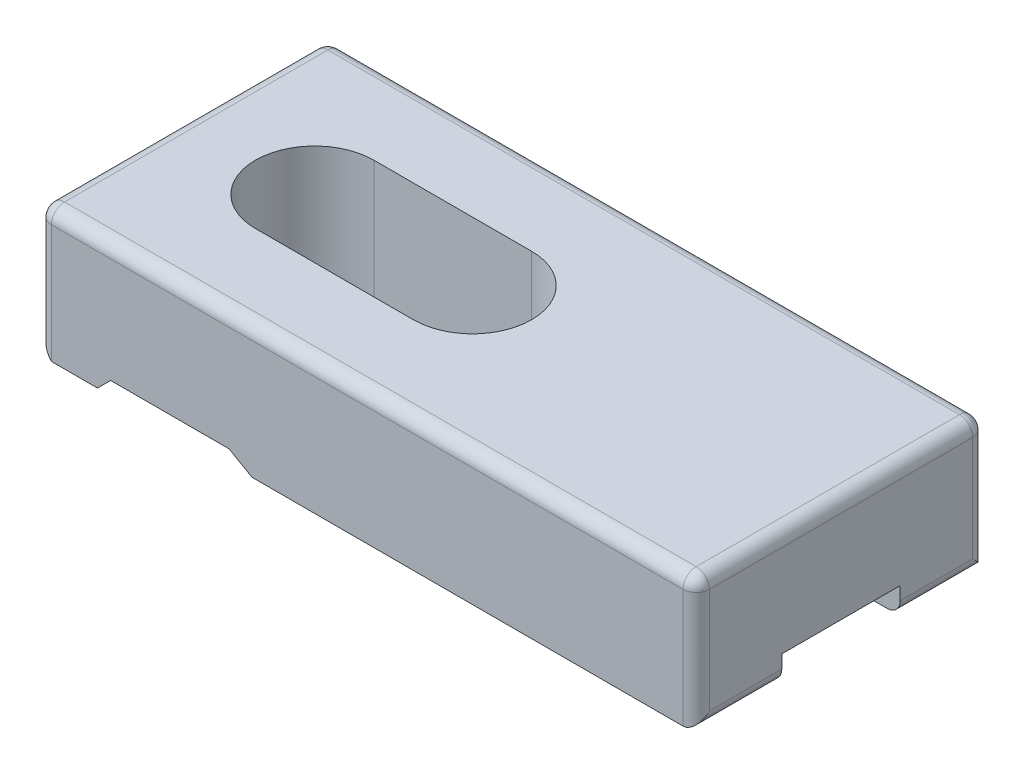
ISO-10303-21;
HEADER;
FILE_DESCRIPTION(('STEP AP214'),'2;1');
FILE_NAME('part.step','',(''),(''),'','','');
FILE_SCHEMA(('AUTOMOTIVE_DESIGN { 1 0 10303 214 1 1 1 1 }'));
ENDSEC;
DATA;
#1=APPLICATION_CONTEXT('core data for automotive mechanical design processes');
#2=APPLICATION_PROTOCOL_DEFINITION('international standard','automotive_design',2000,#1);
#3=PRODUCT_CONTEXT('',#1,'mechanical');
#4=PRODUCT('Part','Part','',(#3));
#5=PRODUCT_RELATED_PRODUCT_CATEGORY('part','',(#4));
#6=PRODUCT_DEFINITION_FORMATION('','',#4);
#7=PRODUCT_DEFINITION_CONTEXT('part definition',#1,'design');
#8=PRODUCT_DEFINITION('design','',#6,#7);
#9=PRODUCT_DEFINITION_SHAPE('','',#8);
#10=(LENGTH_UNIT() NAMED_UNIT(*) SI_UNIT(.MILLI.,.METRE.));
#11=(NAMED_UNIT(*) PLANE_ANGLE_UNIT() SI_UNIT($,.RADIAN.));
#12=(NAMED_UNIT(*) SI_UNIT($,.STERADIAN.) SOLID_ANGLE_UNIT());
#13=UNCERTAINTY_MEASURE_WITH_UNIT(LENGTH_MEASURE(1.E-05),#10,'distance_accuracy_value','');
#14=(GEOMETRIC_REPRESENTATION_CONTEXT(3) GLOBAL_UNCERTAINTY_ASSIGNED_CONTEXT((#13)) GLOBAL_UNIT_ASSIGNED_CONTEXT((#10,
#11,#12)) REPRESENTATION_CONTEXT('',''));
#15=CARTESIAN_POINT('',(0.,0.,0.));
#16=DIRECTION('',(0.,0.,1.));
#17=DIRECTION('',(1.,0.,0.));
#18=AXIS2_PLACEMENT_3D('',#15,#16,#17);
#19=CARTESIAN_POINT('',(0.,0.,0.));
#20=DIRECTION('',(0.,-1.,0.));
#21=DIRECTION('',(0.,0.,-1.));
#22=AXIS2_PLACEMENT_3D('',#19,#20,#21);
#23=PLANE('',#22);
#24=DIRECTION('',(-1.,0.,0.));
#25=VECTOR('',#24,1.);
#26=CARTESIAN_POINT('',(0.,0.,-6.5));
#27=LINE('',#26,#25);
#28=CARTESIAN_POINT('',(4.49999999999999,0.,-6.5));
#29=VERTEX_POINT('',#28);
#30=CARTESIAN_POINT('',(1.00000000000001,0.,-6.5));
#31=VERTEX_POINT('',#30);
#32=EDGE_CURVE('E260',#29,#31,#27,.T.);
#33=ORIENTED_EDGE('',*,*,#32,.F.);
#34=DIRECTION('',(0.,0.,1.));
#35=VECTOR('',#34,1.);
#36=CARTESIAN_POINT('',(4.49999999999999,0.,0.));
#37=LINE('',#36,#35);
#38=CARTESIAN_POINT('',(4.49999999999999,0.,0.));
#39=VERTEX_POINT('',#38);
#40=EDGE_CURVE('E348',#29,#39,#37,.T.);
#41=ORIENTED_EDGE('',*,*,#40,.T.);
#42=DIRECTION('',(1.,0.,0.));
#43=VECTOR('',#42,1.);
#44=CARTESIAN_POINT('',(0.,0.,0.));
#45=LINE('',#44,#43);
#46=CARTESIAN_POINT('',(1.00000000000001,0.,0.));
#47=VERTEX_POINT('',#46);
#48=EDGE_CURVE('E328',#47,#39,#45,.T.);
#49=ORIENTED_EDGE('',*,*,#48,.F.);
#50=DIRECTION('',(0.,0.,-1.));
#51=VECTOR('',#50,1.);
#52=CARTESIAN_POINT('',(1.00000000000001,0.,-6.5));
#53=LINE('',#52,#51);
#54=EDGE_CURVE('E346',#47,#31,#53,.T.);
#55=ORIENTED_EDGE('',*,*,#54,.T.);
#56=EDGE_LOOP('',(#33,#41,#49,#55));
#57=FACE_BOUND('',#56,.T.);
#58=ADVANCED_FACE('F36',(#57),#23,.T.);
#59=DIRECTION('',(-1.,0.,0.));
#60=VECTOR('',#59,1.);
#61=CARTESIAN_POINT('',(0.,0.,-22.));
#62=LINE('',#61,#60);
#63=CARTESIAN_POINT('',(49.,0.,-22.));
#64=VERTEX_POINT('',#63);
#65=CARTESIAN_POINT('',(16.2320508075689,0.,-22.));
#66=VERTEX_POINT('',#65);
#67=EDGE_CURVE('E332',#64,#66,#62,.T.);
#68=ORIENTED_EDGE('',*,*,#67,.F.);
#69=DIRECTION('',(0.,0.,-1.));
#70=VECTOR('',#69,1.);
#71=CARTESIAN_POINT('',(49.,0.,-15.5));
#72=LINE('',#71,#70);
#73=CARTESIAN_POINT('',(49.,0.,-15.5));
#74=VERTEX_POINT('',#73);
#75=EDGE_CURVE('E61',#64,#74,#72,.F.);
#76=ORIENTED_EDGE('',*,*,#75,.T.);
#77=DIRECTION('',(-1.,0.,0.));
#78=VECTOR('',#77,1.);
#79=CARTESIAN_POINT('',(22.,0.,-15.5));
#80=LINE('',#79,#78);
#81=CARTESIAN_POINT('',(16.2320508075689,0.,-15.5));
#82=VERTEX_POINT('',#81);
#83=EDGE_CURVE('E302',#74,#82,#80,.T.);
#84=ORIENTED_EDGE('',*,*,#83,.T.);
#85=DIRECTION('',(0.,0.,-1.));
#86=VECTOR('',#85,1.);
#87=CARTESIAN_POINT('',(16.2320508075689,0.,-22.));
#88=LINE('',#87,#86);
#89=EDGE_CURVE('E355',#82,#66,#88,.T.);
#90=ORIENTED_EDGE('',*,*,#89,.T.);
#91=EDGE_LOOP('',(#68,#76,#84,#90));
#92=FACE_BOUND('',#91,.T.);
#93=ADVANCED_FACE('F556',(#92),#23,.T.);
#94=DIRECTION('',(1.,0.,0.));
#95=VECTOR('',#94,1.);
#96=CARTESIAN_POINT('',(22.,0.,-6.5));
#97=LINE('',#96,#95);
#98=CARTESIAN_POINT('',(16.2320508075689,0.,-6.5));
#99=VERTEX_POINT('',#98);
#100=CARTESIAN_POINT('',(49.,0.,-6.5));
#101=VERTEX_POINT('',#100);
#102=EDGE_CURVE('E306',#99,#101,#97,.T.);
#103=ORIENTED_EDGE('',*,*,#102,.T.);
#104=DIRECTION('',(0.,0.,-1.));
#105=VECTOR('',#104,1.);
#106=CARTESIAN_POINT('',(49.,0.,0.));
#107=LINE('',#106,#105);
#108=CARTESIAN_POINT('',(49.,0.,0.));
#109=VERTEX_POINT('',#108);
#110=EDGE_CURVE('E406',#101,#109,#107,.F.);
#111=ORIENTED_EDGE('',*,*,#110,.T.);
#112=CARTESIAN_POINT('',(16.2320508075689,0.,0.));
#113=VERTEX_POINT('',#112);
#114=EDGE_CURVE('E327',#113,#109,#45,.T.);
#115=ORIENTED_EDGE('',*,*,#114,.F.);
#116=DIRECTION('',(0.,0.,-1.));
#117=VECTOR('',#116,1.);
#118=CARTESIAN_POINT('',(16.2320508075689,0.,-6.5));
#119=LINE('',#118,#117);
#120=EDGE_CURVE('E362',#113,#99,#119,.T.);
#121=ORIENTED_EDGE('',*,*,#120,.T.);
#122=EDGE_LOOP('',(#103,#111,#115,#121));
#123=FACE_BOUND('',#122,.T.);
#124=ADVANCED_FACE('F558',(#123),#23,.T.);
#125=CARTESIAN_POINT('',(10.,10.,-11.));
#126=DIRECTION('',(0.,-1.,0.));
#127=DIRECTION('',(0.,0.,-1.));
#128=AXIS2_PLACEMENT_3D('',#125,#126,#127);
#129=CYLINDRICAL_SURFACE('',#128,4.5);
#130=DIRECTION('',(0.,-1.,0.));
#131=VECTOR('',#130,1.);
#132=CARTESIAN_POINT('',(10.,10.,-6.5));
#133=LINE('',#132,#131);
#134=CARTESIAN_POINT('',(10.,10.,-6.5));
#135=VERTEX_POINT('',#134);
#136=CARTESIAN_POINT('',(10.,0.999999999999999,-6.5));
#137=VERTEX_POINT('',#136);
#138=EDGE_CURVE('E318',#135,#137,#133,.T.);
#139=ORIENTED_EDGE('',*,*,#138,.T.);
#140=CARTESIAN_POINT('',(10.,0.999999999999999,-11.));
#141=DIRECTION('',(0.,-1.,0.));
#142=DIRECTION('',(0.,0.,-1.));
#143=AXIS2_PLACEMENT_3D('',#140,#141,#142);
#144=CIRCLE('',#143,4.5);
#145=CARTESIAN_POINT('',(10.,0.999999999999999,-15.5));
#146=VERTEX_POINT('',#145);
#147=EDGE_CURVE('E280',#137,#146,#144,.T.);
#148=ORIENTED_EDGE('',*,*,#147,.T.);
#149=DIRECTION('',(0.,-1.,0.));
#150=VECTOR('',#149,1.);
#151=CARTESIAN_POINT('',(10.,10.,-15.5));
#152=LINE('',#151,#150);
#153=CARTESIAN_POINT('',(10.,10.,-15.5));
#154=VERTEX_POINT('',#153);
#155=EDGE_CURVE('E321',#154,#146,#152,.T.);
#156=ORIENTED_EDGE('',*,*,#155,.F.);
#157=CARTESIAN_POINT('',(10.,10.,-11.));
#158=DIRECTION('',(0.,1.,0.));
#159=DIRECTION('',(0.,0.,1.));
#160=AXIS2_PLACEMENT_3D('',#157,#158,#159);
#161=CIRCLE('',#160,4.5);
#162=EDGE_CURVE('E308',#154,#135,#161,.T.);
#163=ORIENTED_EDGE('',*,*,#162,.T.);
#164=EDGE_LOOP('',(#139,#148,#156,#163));
#165=FACE_BOUND('',#164,.T.);
#166=ADVANCED_FACE('F480',(#165),#129,.F.);
#167=CARTESIAN_POINT('',(22.,10.,-11.));
#168=DIRECTION('',(0.,-1.,0.));
#169=DIRECTION('',(0.,0.,-1.));
#170=AXIS2_PLACEMENT_3D('',#167,#168,#169);
#171=CYLINDRICAL_SURFACE('',#170,4.5);
#172=DIRECTION('',(0.,-1.,0.));
#173=VECTOR('',#172,1.);
#174=CARTESIAN_POINT('',(22.,10.,-15.5));
#175=LINE('',#174,#173);
#176=CARTESIAN_POINT('',(22.,10.,-15.5));
#177=VERTEX_POINT('',#176);
#178=CARTESIAN_POINT('',(22.,2.,-15.5));
#179=VERTEX_POINT('',#178);
#180=EDGE_CURVE('E324',#177,#179,#175,.T.);
#181=ORIENTED_EDGE('',*,*,#180,.T.);
#182=CARTESIAN_POINT('',(22.,2.,-11.));
#183=DIRECTION('',(0.,-1.,0.));
#184=DIRECTION('',(0.,0.,-1.));
#185=AXIS2_PLACEMENT_3D('',#182,#183,#184);
#186=CIRCLE('',#185,4.5);
#187=CARTESIAN_POINT('',(22.,2.,-6.5));
#188=VERTEX_POINT('',#187);
#189=EDGE_CURVE('E297',#179,#188,#186,.T.);
#190=ORIENTED_EDGE('',*,*,#189,.T.);
#191=DIRECTION('',(0.,-1.,0.));
#192=VECTOR('',#191,1.);
#193=CARTESIAN_POINT('',(22.,10.,-6.5));
#194=LINE('',#193,#192);
#195=CARTESIAN_POINT('',(22.,10.,-6.5));
#196=VERTEX_POINT('',#195);
#197=EDGE_CURVE('E313',#196,#188,#194,.T.);
#198=ORIENTED_EDGE('',*,*,#197,.F.);
#199=CARTESIAN_POINT('',(22.,10.,-11.));
#200=DIRECTION('',(0.,1.,0.));
#201=DIRECTION('',(0.,0.,1.));
#202=AXIS2_PLACEMENT_3D('',#199,#200,#201);
#203=CIRCLE('',#202,4.5);
#204=EDGE_CURVE('E303',#196,#177,#203,.T.);
#205=ORIENTED_EDGE('',*,*,#204,.T.);
#206=EDGE_LOOP('',(#181,#190,#198,#205));
#207=FACE_BOUND('',#206,.T.);
#208=ADVANCED_FACE('F471',(#207),#171,.F.);
#209=CARTESIAN_POINT('',(0.,10.,0.));
#210=DIRECTION('',(0.,-1.,0.));
#211=DIRECTION('',(0.,0.,-1.));
#212=AXIS2_PLACEMENT_3D('',#209,#210,#211);
#213=PLANE('',#212);
#214=DIRECTION('',(-1.,0.,0.));
#215=VECTOR('',#214,1.);
#216=CARTESIAN_POINT('',(0.,10.,-21.));
#217=LINE('',#216,#215);
#218=CARTESIAN_POINT('',(49.,10.,-21.));
#219=VERTEX_POINT('',#218);
#220=CARTESIAN_POINT('',(1.,10.,-21.));
#221=VERTEX_POINT('',#220);
#222=EDGE_CURVE('E370',#219,#221,#217,.T.);
#223=ORIENTED_EDGE('',*,*,#222,.T.);
#224=DIRECTION('',(0.,0.,1.));
#225=VECTOR('',#224,1.);
#226=CARTESIAN_POINT('',(1.,10.,0.));
#227=LINE('',#226,#225);
#228=CARTESIAN_POINT('',(1.,10.,-1.));
#229=VERTEX_POINT('',#228);
#230=EDGE_CURVE('E372',#221,#229,#227,.T.);
#231=ORIENTED_EDGE('',*,*,#230,.T.);
#232=DIRECTION('',(1.,0.,0.));
#233=VECTOR('',#232,1.);
#234=CARTESIAN_POINT('',(0.,10.,-1.));
#235=LINE('',#234,#233);
#236=CARTESIAN_POINT('',(49.,10.,-1.));
#237=VERTEX_POINT('',#236);
#238=EDGE_CURVE('E366',#229,#237,#235,.T.);
#239=ORIENTED_EDGE('',*,*,#238,.T.);
#240=DIRECTION('',(0.,0.,-1.));
#241=VECTOR('',#240,1.);
#242=CARTESIAN_POINT('',(49.,10.,0.));
#243=LINE('',#242,#241);
#244=EDGE_CURVE('E368',#237,#219,#243,.T.);
#245=ORIENTED_EDGE('',*,*,#244,.T.);
#246=EDGE_LOOP('',(#223,#231,#239,#245));
#247=FACE_BOUND('',#246,.T.);
#248=ORIENTED_EDGE('',*,*,#204,.F.);
#249=DIRECTION('',(1.,0.,0.));
#250=VECTOR('',#249,1.);
#251=CARTESIAN_POINT('',(22.,10.,-6.5));
#252=LINE('',#251,#250);
#253=EDGE_CURVE('E311',#135,#196,#252,.T.);
#254=ORIENTED_EDGE('',*,*,#253,.F.);
#255=ORIENTED_EDGE('',*,*,#162,.F.);
#256=DIRECTION('',(-1.,0.,0.));
#257=VECTOR('',#256,1.);
#258=CARTESIAN_POINT('',(22.,10.,-15.5));
#259=LINE('',#258,#257);
#260=EDGE_CURVE('E305',#177,#154,#259,.T.);
#261=ORIENTED_EDGE('',*,*,#260,.F.);
#262=EDGE_LOOP('',(#248,#254,#255,#261));
#263=FACE_BOUND('',#262,.T.);
#264=ADVANCED_FACE('F476',(#247,#263),#213,.F.);
#265=CARTESIAN_POINT('',(4.49999999999999,0.,-22.));
#266=VERTEX_POINT('',#265);
#267=CARTESIAN_POINT('',(1.00000000000001,0.,-22.));
#268=VERTEX_POINT('',#267);
#269=EDGE_CURVE('E331',#266,#268,#62,.T.);
#270=ORIENTED_EDGE('',*,*,#269,.F.);
#271=DIRECTION('',(0.,0.,1.));
#272=VECTOR('',#271,1.);
#273=CARTESIAN_POINT('',(4.49999999999999,0.,-15.5));
#274=LINE('',#273,#272);
#275=CARTESIAN_POINT('',(4.49999999999999,0.,-15.5));
#276=VERTEX_POINT('',#275);
#277=EDGE_CURVE('E244',#266,#276,#274,.T.);
#278=ORIENTED_EDGE('',*,*,#277,.T.);
#279=DIRECTION('',(1.,0.,0.));
#280=VECTOR('',#279,1.);
#281=CARTESIAN_POINT('',(0.,0.,-15.5));
#282=LINE('',#281,#280);
#283=CARTESIAN_POINT('',(1.00000000000001,0.,-15.5));
#284=VERTEX_POINT('',#283);
#285=EDGE_CURVE('E263',#284,#276,#282,.T.);
#286=ORIENTED_EDGE('',*,*,#285,.F.);
#287=DIRECTION('',(0.,0.,-1.));
#288=VECTOR('',#287,1.);
#289=CARTESIAN_POINT('',(1.00000000000001,0.,-22.));
#290=LINE('',#289,#288);
#291=EDGE_CURVE('E239',#284,#268,#290,.T.);
#292=ORIENTED_EDGE('',*,*,#291,.T.);
#293=EDGE_LOOP('',(#270,#278,#286,#292));
#294=FACE_BOUND('',#293,.T.);
#295=ADVANCED_FACE('F544',(#294),#23,.T.);
#296=CARTESIAN_POINT('',(0.,10.,0.));
#297=DIRECTION('',(1.,0.,0.));
#298=DIRECTION('',(0.,0.,-1.));
#299=AXIS2_PLACEMENT_3D('',#296,#297,#298);
#300=PLANE('',#299);
#301=DIRECTION('',(0.,0.,1.));
#302=VECTOR('',#301,1.);
#303=CARTESIAN_POINT('',(0.,9.,0.));
#304=LINE('',#303,#302);
#305=CARTESIAN_POINT('',(0.,9.,-1.));
#306=VERTEX_POINT('',#305);
#307=CARTESIAN_POINT('',(0.,9.,-21.));
#308=VERTEX_POINT('',#307);
#309=EDGE_CURVE('E377',#306,#308,#304,.F.);
#310=ORIENTED_EDGE('',*,*,#309,.T.);
#311=DIRECTION('',(0.,-1.,0.));
#312=VECTOR('',#311,1.);
#313=CARTESIAN_POINT('',(0.,10.,-21.));
#314=LINE('',#313,#312);
#315=CARTESIAN_POINT('',(0.,1.00000000000001,-21.));
#316=VERTEX_POINT('',#315);
#317=EDGE_CURVE('E228',#308,#316,#314,.T.);
#318=ORIENTED_EDGE('',*,*,#317,.T.);
#319=DIRECTION('',(0.,0.,1.));
#320=VECTOR('',#319,1.);
#321=CARTESIAN_POINT('',(0.,1.00000000000001,-15.5));
#322=LINE('',#321,#320);
#323=CARTESIAN_POINT('',(0.,1.,-15.5));
#324=VERTEX_POINT('',#323);
#325=EDGE_CURVE('E219',#316,#324,#322,.T.);
#326=ORIENTED_EDGE('',*,*,#325,.T.);
#327=DIRECTION('',(0.,0.,-1.));
#328=VECTOR('',#327,1.);
#329=CARTESIAN_POINT('',(0.,1.,-6.5));
#330=LINE('',#329,#328);
#331=CARTESIAN_POINT('',(0.,1.,-6.5));
#332=VERTEX_POINT('',#331);
#333=EDGE_CURVE('E225',#332,#324,#330,.T.);
#334=ORIENTED_EDGE('',*,*,#333,.F.);
#335=DIRECTION('',(0.,0.,1.));
#336=VECTOR('',#335,1.);
#337=CARTESIAN_POINT('',(0.,1.00000000000001,0.));
#338=LINE('',#337,#336);
#339=CARTESIAN_POINT('',(0.,1.00000000000001,-1.));
#340=VERTEX_POINT('',#339);
#341=EDGE_CURVE('E231',#332,#340,#338,.T.);
#342=ORIENTED_EDGE('',*,*,#341,.T.);
#343=DIRECTION('',(0.,-1.,0.));
#344=VECTOR('',#343,1.);
#345=CARTESIAN_POINT('',(0.,10.,-1.));
#346=LINE('',#345,#344);
#347=EDGE_CURVE('E375',#340,#306,#346,.F.);
#348=ORIENTED_EDGE('',*,*,#347,.T.);
#349=EDGE_LOOP('',(#310,#318,#326,#334,#342,#348));
#350=FACE_BOUND('',#349,.T.);
#351=ADVANCED_FACE('F222',(#350),#300,.F.);
#352=CARTESIAN_POINT('',(0.,10.,0.));
#353=DIRECTION('',(0.,0.,-1.));
#354=DIRECTION('',(-1.,0.,0.));
#355=AXIS2_PLACEMENT_3D('',#352,#353,#354);
#356=PLANE('',#355);
#357=ORIENTED_EDGE('',*,*,#114,.T.);
#358=DIRECTION('',(0.,-1.,0.));
#359=VECTOR('',#358,1.);
#360=CARTESIAN_POINT('',(49.,10.,0.));
#361=LINE('',#360,#359);
#362=CARTESIAN_POINT('',(49.,9.,0.));
#363=VERTEX_POINT('',#362);
#364=EDGE_CURVE('E400',#109,#363,#361,.F.);
#365=ORIENTED_EDGE('',*,*,#364,.T.);
#366=DIRECTION('',(1.,0.,0.));
#367=VECTOR('',#366,1.);
#368=CARTESIAN_POINT('',(0.,9.,0.));
#369=LINE('',#368,#367);
#370=CARTESIAN_POINT('',(1.,9.,0.));
#371=VERTEX_POINT('',#370);
#372=EDGE_CURVE('E398',#363,#371,#369,.F.);
#373=ORIENTED_EDGE('',*,*,#372,.T.);
#374=DIRECTION('',(0.,-1.,0.));
#375=VECTOR('',#374,1.);
#376=CARTESIAN_POINT('',(1.,10.,0.));
#377=LINE('',#376,#375);
#378=EDGE_CURVE('E396',#371,#47,#377,.T.);
#379=ORIENTED_EDGE('',*,*,#378,.T.);
#380=ORIENTED_EDGE('',*,*,#48,.T.);
#381=DIRECTION('',(0.707106781186548,0.707106781186548,0.));
#382=VECTOR('',#381,1.);
#383=CARTESIAN_POINT('',(5.5,1.00000000000001,0.));
#384=LINE('',#383,#382);
#385=CARTESIAN_POINT('',(5.5,1.,0.));
#386=VERTEX_POINT('',#385);
#387=EDGE_CURVE('E232',#39,#386,#384,.T.);
#388=ORIENTED_EDGE('',*,*,#387,.T.);
#389=DIRECTION('',(-1.,0.,0.));
#390=VECTOR('',#389,1.);
#391=CARTESIAN_POINT('',(5.5,1.,0.));
#392=LINE('',#391,#390);
#393=CARTESIAN_POINT('',(14.5,1.,0.));
#394=VERTEX_POINT('',#393);
#395=EDGE_CURVE('E274',#394,#386,#392,.T.);
#396=ORIENTED_EDGE('',*,*,#395,.F.);
#397=DIRECTION('',(0.866025403784438,-0.500000000000001,0.));
#398=VECTOR('',#397,1.);
#399=CARTESIAN_POINT('',(14.5,1.,0.));
#400=LINE('',#399,#398);
#401=EDGE_CURVE('E360',#394,#113,#400,.T.);
#402=ORIENTED_EDGE('',*,*,#401,.T.);
#403=EDGE_LOOP('',(#357,#365,#373,#379,#380,#388,#396,#402));
#404=FACE_BOUND('',#403,.T.);
#405=ADVANCED_FACE('F493',(#404),#356,.F.);
#406=CARTESIAN_POINT('',(50.,10.,0.));
#407=DIRECTION('',(-1.,0.,0.));
#408=DIRECTION('',(0.,0.,1.));
#409=AXIS2_PLACEMENT_3D('',#406,#407,#408);
#410=PLANE('',#409);
#411=DIRECTION('',(0.,-1.,0.));
#412=VECTOR('',#411,1.);
#413=CARTESIAN_POINT('',(50.,10.,-1.));
#414=LINE('',#413,#412);
#415=CARTESIAN_POINT('',(50.,9.,-1.));
#416=VERTEX_POINT('',#415);
#417=CARTESIAN_POINT('',(50.,0.999999999999999,-1.));
#418=VERTEX_POINT('',#417);
#419=EDGE_CURVE('E392',#416,#418,#414,.T.);
#420=ORIENTED_EDGE('',*,*,#419,.T.);
#421=DIRECTION('',(0.,0.,-1.));
#422=VECTOR('',#421,1.);
#423=CARTESIAN_POINT('',(50.,0.999999999999999,-6.5));
#424=LINE('',#423,#422);
#425=CARTESIAN_POINT('',(50.,0.999999999999999,-6.5));
#426=VERTEX_POINT('',#425);
#427=EDGE_CURVE('E394',#418,#426,#424,.T.);
#428=ORIENTED_EDGE('',*,*,#427,.T.);
#429=DIRECTION('',(0.,-1.,0.));
#430=VECTOR('',#429,1.);
#431=CARTESIAN_POINT('',(50.,2.,-6.5));
#432=LINE('',#431,#430);
#433=CARTESIAN_POINT('',(50.,2.,-6.5));
#434=VERTEX_POINT('',#433);
#435=EDGE_CURVE('E295',#434,#426,#432,.T.);
#436=ORIENTED_EDGE('',*,*,#435,.F.);
#437=DIRECTION('',(0.,0.,1.));
#438=VECTOR('',#437,1.);
#439=CARTESIAN_POINT('',(50.,2.,-6.5));
#440=LINE('',#439,#438);
#441=CARTESIAN_POINT('',(50.,2.,-15.5));
#442=VERTEX_POINT('',#441);
#443=EDGE_CURVE('E291',#442,#434,#440,.T.);
#444=ORIENTED_EDGE('',*,*,#443,.F.);
#445=DIRECTION('',(0.,-1.,0.));
#446=VECTOR('',#445,1.);
#447=CARTESIAN_POINT('',(50.,2.,-15.5));
#448=LINE('',#447,#446);
#449=CARTESIAN_POINT('',(50.,0.999999999999999,-15.5));
#450=VERTEX_POINT('',#449);
#451=EDGE_CURVE('E294',#442,#450,#448,.T.);
#452=ORIENTED_EDGE('',*,*,#451,.T.);
#453=DIRECTION('',(0.,0.,-1.));
#454=VECTOR('',#453,1.);
#455=CARTESIAN_POINT('',(50.,0.999999999999999,-22.));
#456=LINE('',#455,#454);
#457=CARTESIAN_POINT('',(50.,0.999999999999999,-21.));
#458=VERTEX_POINT('',#457);
#459=EDGE_CURVE('E388',#450,#458,#456,.T.);
#460=ORIENTED_EDGE('',*,*,#459,.T.);
#461=DIRECTION('',(0.,-1.,0.));
#462=VECTOR('',#461,1.);
#463=CARTESIAN_POINT('',(50.,10.,-21.));
#464=LINE('',#463,#462);
#465=CARTESIAN_POINT('',(50.,9.,-21.));
#466=VERTEX_POINT('',#465);
#467=EDGE_CURVE('E386',#458,#466,#464,.F.);
#468=ORIENTED_EDGE('',*,*,#467,.T.);
#469=DIRECTION('',(0.,0.,-1.));
#470=VECTOR('',#469,1.);
#471=CARTESIAN_POINT('',(50.,9.,0.));
#472=LINE('',#471,#470);
#473=EDGE_CURVE('E390',#466,#416,#472,.F.);
#474=ORIENTED_EDGE('',*,*,#473,.T.);
#475=EDGE_LOOP('',(#420,#428,#436,#444,#452,#460,#468,#474));
#476=FACE_BOUND('',#475,.T.);
#477=ADVANCED_FACE('F464',(#476),#410,.F.);
#478=CARTESIAN_POINT('',(0.,10.,-22.));
#479=DIRECTION('',(0.,0.,1.));
#480=DIRECTION('',(1.,0.,0.));
#481=AXIS2_PLACEMENT_3D('',#478,#479,#480);
#482=PLANE('',#481);
#483=DIRECTION('',(-1.,0.,0.));
#484=VECTOR('',#483,1.);
#485=CARTESIAN_POINT('',(0.,9.,-22.));
#486=LINE('',#485,#484);
#487=CARTESIAN_POINT('',(1.,9.,-22.));
#488=VERTEX_POINT('',#487);
#489=CARTESIAN_POINT('',(49.,9.,-22.));
#490=VERTEX_POINT('',#489);
#491=EDGE_CURVE('E382',#488,#490,#486,.F.);
#492=ORIENTED_EDGE('',*,*,#491,.T.);
#493=DIRECTION('',(0.,-1.,0.));
#494=VECTOR('',#493,1.);
#495=CARTESIAN_POINT('',(49.,10.,-22.));
#496=LINE('',#495,#494);
#497=EDGE_CURVE('E384',#490,#64,#496,.T.);
#498=ORIENTED_EDGE('',*,*,#497,.T.);
#499=ORIENTED_EDGE('',*,*,#67,.T.);
#500=DIRECTION('',(-0.866025403784438,0.500000000000001,0.));
#501=VECTOR('',#500,1.);
#502=CARTESIAN_POINT('',(14.5,1.,-22.));
#503=LINE('',#502,#501);
#504=CARTESIAN_POINT('',(14.5,1.,-22.));
#505=VERTEX_POINT('',#504);
#506=EDGE_CURVE('E358',#66,#505,#503,.T.);
#507=ORIENTED_EDGE('',*,*,#506,.T.);
#508=DIRECTION('',(1.,0.,0.));
#509=VECTOR('',#508,1.);
#510=CARTESIAN_POINT('',(5.5,1.,-22.));
#511=LINE('',#510,#509);
#512=CARTESIAN_POINT('',(5.5,1.,-22.));
#513=VERTEX_POINT('',#512);
#514=EDGE_CURVE('E267',#513,#505,#511,.T.);
#515=ORIENTED_EDGE('',*,*,#514,.F.);
#516=DIRECTION('',(-0.707106781186547,-0.707106781186548,0.));
#517=VECTOR('',#516,1.);
#518=CARTESIAN_POINT('',(5.5,1.00000000000001,-22.));
#519=LINE('',#518,#517);
#520=EDGE_CURVE('E337',#513,#266,#519,.T.);
#521=ORIENTED_EDGE('',*,*,#520,.T.);
#522=ORIENTED_EDGE('',*,*,#269,.T.);
#523=DIRECTION('',(0.,-1.,0.));
#524=VECTOR('',#523,1.);
#525=CARTESIAN_POINT('',(1.,10.,-22.));
#526=LINE('',#525,#524);
#527=EDGE_CURVE('E380',#268,#488,#526,.F.);
#528=ORIENTED_EDGE('',*,*,#527,.T.);
#529=EDGE_LOOP('',(#492,#498,#499,#507,#515,#521,#522,#528));
#530=FACE_BOUND('',#529,.T.);
#531=ADVANCED_FACE('F547',(#530),#482,.F.);
#532=CARTESIAN_POINT('',(22.,10.,-15.5));
#533=DIRECTION('',(0.,0.,1.));
#534=DIRECTION('',(1.,0.,0.));
#535=AXIS2_PLACEMENT_3D('',#532,#533,#534);
#536=PLANE('',#535);
#537=ORIENTED_EDGE('',*,*,#83,.F.);
#538=CARTESIAN_POINT('',(49.,0.999999999999999,-15.5));
#539=DIRECTION('',(0.,0.,1.));
#540=DIRECTION('',(1.,0.,0.));
#541=AXIS2_PLACEMENT_3D('',#538,#539,#540);
#542=CIRCLE('',#541,1.);
#543=EDGE_CURVE('E403',#74,#450,#542,.T.);
#544=ORIENTED_EDGE('',*,*,#543,.T.);
#545=ORIENTED_EDGE('',*,*,#451,.F.);
#546=DIRECTION('',(1.,0.,0.));
#547=VECTOR('',#546,1.);
#548=CARTESIAN_POINT('',(50.,2.,-15.5));
#549=LINE('',#548,#547);
#550=EDGE_CURVE('E289',#179,#442,#549,.T.);
#551=ORIENTED_EDGE('',*,*,#550,.F.);
#552=ORIENTED_EDGE('',*,*,#180,.F.);
#553=ORIENTED_EDGE('',*,*,#260,.T.);
#554=ORIENTED_EDGE('',*,*,#155,.T.);
#555=DIRECTION('',(1.,0.,0.));
#556=VECTOR('',#555,1.);
#557=CARTESIAN_POINT('',(22.,0.999999999999999,-15.5));
#558=LINE('',#557,#556);
#559=CARTESIAN_POINT('',(14.5,1.,-15.5));
#560=VERTEX_POINT('',#559);
#561=EDGE_CURVE('E284',#146,#560,#558,.T.);
#562=ORIENTED_EDGE('',*,*,#561,.T.);
#563=DIRECTION('',(0.866025403784438,-0.500000000000001,0.));
#564=VECTOR('',#563,1.);
#565=CARTESIAN_POINT('',(16.22788568297,0.00240473580836141,-15.5));
#566=LINE('',#565,#564);
#567=EDGE_CURVE('E352',#560,#82,#566,.T.);
#568=ORIENTED_EDGE('',*,*,#567,.T.);
#569=EDGE_LOOP('',(#537,#544,#545,#551,#552,#553,#554,#562,#568));
#570=FACE_BOUND('',#569,.T.);
#571=ADVANCED_FACE('F460',(#570),#536,.T.);
#572=CARTESIAN_POINT('',(22.,10.,-6.5));
#573=DIRECTION('',(0.,0.,-1.));
#574=DIRECTION('',(-1.,0.,0.));
#575=AXIS2_PLACEMENT_3D('',#572,#573,#574);
#576=PLANE('',#575);
#577=ORIENTED_EDGE('',*,*,#435,.T.);
#578=CARTESIAN_POINT('',(49.,0.999999999999999,-6.5));
#579=DIRECTION('',(0.,0.,-1.));
#580=DIRECTION('',(-1.,0.,0.));
#581=AXIS2_PLACEMENT_3D('',#578,#579,#580);
#582=CIRCLE('',#581,1.);
#583=EDGE_CURVE('E53',#426,#101,#582,.T.);
#584=ORIENTED_EDGE('',*,*,#583,.T.);
#585=ORIENTED_EDGE('',*,*,#102,.F.);
#586=DIRECTION('',(-0.866025403784438,0.500000000000001,0.));
#587=VECTOR('',#586,1.);
#588=CARTESIAN_POINT('',(16.22788568297,0.00240473580836141,-6.5));
#589=LINE('',#588,#587);
#590=CARTESIAN_POINT('',(14.5,1.,-6.5));
#591=VERTEX_POINT('',#590);
#592=EDGE_CURVE('E364',#99,#591,#589,.T.);
#593=ORIENTED_EDGE('',*,*,#592,.T.);
#594=DIRECTION('',(-1.,0.,0.));
#595=VECTOR('',#594,1.);
#596=CARTESIAN_POINT('',(22.,0.999999999999999,-6.5));
#597=LINE('',#596,#595);
#598=EDGE_CURVE('E334',#591,#137,#597,.T.);
#599=ORIENTED_EDGE('',*,*,#598,.T.);
#600=ORIENTED_EDGE('',*,*,#138,.F.);
#601=ORIENTED_EDGE('',*,*,#253,.T.);
#602=ORIENTED_EDGE('',*,*,#197,.T.);
#603=DIRECTION('',(-1.,0.,0.));
#604=VECTOR('',#603,1.);
#605=CARTESIAN_POINT('',(10.,2.,-6.5));
#606=LINE('',#605,#604);
#607=EDGE_CURVE('E287',#434,#188,#606,.T.);
#608=ORIENTED_EDGE('',*,*,#607,.F.);
#609=EDGE_LOOP('',(#577,#584,#585,#593,#599,#600,#601,#602,#608));
#610=FACE_BOUND('',#609,.T.);
#611=ADVANCED_FACE('F484',(#610),#576,.T.);
#612=CARTESIAN_POINT('',(10.,2.,-11.));
#613=DIRECTION('',(0.,-1.,0.));
#614=DIRECTION('',(0.,0.,-1.));
#615=AXIS2_PLACEMENT_3D('',#612,#613,#614);
#616=PLANE('',#615);
#617=ORIENTED_EDGE('',*,*,#550,.T.);
#618=ORIENTED_EDGE('',*,*,#443,.T.);
#619=ORIENTED_EDGE('',*,*,#607,.T.);
#620=ORIENTED_EDGE('',*,*,#189,.F.);
#621=EDGE_LOOP('',(#617,#618,#619,#620));
#622=FACE_BOUND('',#621,.T.);
#623=ADVANCED_FACE('F467',(#622),#616,.T.);
#624=CARTESIAN_POINT('',(0.,1.,-6.5));
#625=DIRECTION('',(0.,0.,1.));
#626=DIRECTION('',(1.,0.,0.));
#627=AXIS2_PLACEMENT_3D('',#624,#625,#626);
#628=PLANE('',#627);
#629=DIRECTION('',(-1.,0.,0.));
#630=VECTOR('',#629,1.);
#631=CARTESIAN_POINT('',(0.,1.,-6.5));
#632=LINE('',#631,#630);
#633=CARTESIAN_POINT('',(5.5,1.,-6.5));
#634=VERTEX_POINT('',#633);
#635=EDGE_CURVE('E259',#634,#332,#632,.T.);
#636=ORIENTED_EDGE('',*,*,#635,.F.);
#637=DIRECTION('',(-0.707106781186548,-0.707106781186548,0.));
#638=VECTOR('',#637,1.);
#639=CARTESIAN_POINT('',(5.5,1.00000000000001,-6.5));
#640=LINE('',#639,#638);
#641=EDGE_CURVE('E344',#634,#29,#640,.T.);
#642=ORIENTED_EDGE('',*,*,#641,.T.);
#643=ORIENTED_EDGE('',*,*,#32,.T.);
#644=DIRECTION('',(-0.707106781186548,0.707106781186548,0.));
#645=VECTOR('',#644,1.);
#646=CARTESIAN_POINT('',(0.,1.00000000000001,-6.5));
#647=LINE('',#646,#645);
#648=EDGE_CURVE('E342',#31,#332,#647,.T.);
#649=ORIENTED_EDGE('',*,*,#648,.T.);
#650=EDGE_LOOP('',(#636,#642,#643,#649));
#651=FACE_BOUND('',#650,.T.);
#652=ADVANCED_FACE('F501',(#651),#628,.F.);
#653=CARTESIAN_POINT('',(0.,1.,-15.5));
#654=DIRECTION('',(0.,0.,-1.));
#655=DIRECTION('',(-1.,0.,0.));
#656=AXIS2_PLACEMENT_3D('',#653,#654,#655);
#657=PLANE('',#656);
#658=ORIENTED_EDGE('',*,*,#285,.T.);
#659=DIRECTION('',(0.707106781186547,0.707106781186548,0.));
#660=VECTOR('',#659,1.);
#661=CARTESIAN_POINT('',(5.5,1.00000000000001,-15.5));
#662=LINE('',#661,#660);
#663=CARTESIAN_POINT('',(5.5,1.,-15.5));
#664=VERTEX_POINT('',#663);
#665=EDGE_CURVE('E243',#276,#664,#662,.T.);
#666=ORIENTED_EDGE('',*,*,#665,.T.);
#667=DIRECTION('',(1.,0.,0.));
#668=VECTOR('',#667,1.);
#669=CARTESIAN_POINT('',(0.,1.,-15.5));
#670=LINE('',#669,#668);
#671=EDGE_CURVE('E247',#324,#664,#670,.T.);
#672=ORIENTED_EDGE('',*,*,#671,.F.);
#673=DIRECTION('',(0.707106781186548,-0.707106781186548,0.));
#674=VECTOR('',#673,1.);
#675=CARTESIAN_POINT('',(0.,1.00000000000001,-15.5));
#676=LINE('',#675,#674);
#677=EDGE_CURVE('E235',#324,#284,#676,.T.);
#678=ORIENTED_EDGE('',*,*,#677,.T.);
#679=EDGE_LOOP('',(#658,#666,#672,#678));
#680=FACE_BOUND('',#679,.T.);
#681=ADVANCED_FACE('F248',(#680),#657,.F.);
#682=CARTESIAN_POINT('',(0.,1.,0.));
#683=DIRECTION('',(0.,-1.,0.));
#684=DIRECTION('',(0.,0.,-1.));
#685=AXIS2_PLACEMENT_3D('',#682,#683,#684);
#686=PLANE('',#685);
#687=ORIENTED_EDGE('',*,*,#147,.F.);
#688=ORIENTED_EDGE('',*,*,#598,.F.);
#689=DIRECTION('',(0.,0.,1.));
#690=VECTOR('',#689,1.);
#691=CARTESIAN_POINT('',(14.5,1.,0.));
#692=LINE('',#691,#690);
#693=EDGE_CURVE('E270',#591,#394,#692,.T.);
#694=ORIENTED_EDGE('',*,*,#693,.T.);
#695=ORIENTED_EDGE('',*,*,#395,.T.);
#696=DIRECTION('',(0.,0.,-1.));
#697=VECTOR('',#696,1.);
#698=CARTESIAN_POINT('',(5.5,1.,0.));
#699=LINE('',#698,#697);
#700=EDGE_CURVE('E277',#386,#634,#699,.T.);
#701=ORIENTED_EDGE('',*,*,#700,.T.);
#702=ORIENTED_EDGE('',*,*,#635,.T.);
#703=ORIENTED_EDGE('',*,*,#333,.T.);
#704=ORIENTED_EDGE('',*,*,#671,.T.);
#705=DIRECTION('',(0.,0.,-1.));
#706=VECTOR('',#705,1.);
#707=CARTESIAN_POINT('',(5.5,1.,-15.5));
#708=LINE('',#707,#706);
#709=EDGE_CURVE('E253',#664,#513,#708,.T.);
#710=ORIENTED_EDGE('',*,*,#709,.T.);
#711=ORIENTED_EDGE('',*,*,#514,.T.);
#712=EDGE_CURVE('E271',#505,#560,#692,.T.);
#713=ORIENTED_EDGE('',*,*,#712,.T.);
#714=ORIENTED_EDGE('',*,*,#561,.F.);
#715=EDGE_LOOP('',(#687,#688,#694,#695,#701,#702,#703,#704,#710,#711,#713,#714));
#716=FACE_BOUND('',#715,.T.);
#717=ADVANCED_FACE('F256',(#716),#686,.T.);
#718=CARTESIAN_POINT('',(5.5,1.00000000000001,-15.5));
#719=DIRECTION('',(0.707106781186548,-0.707106781186547,0.));
#720=DIRECTION('',(0.,0.,1.));
#721=AXIS2_PLACEMENT_3D('',#718,#719,#720);
#722=PLANE('',#721);
#723=ORIENTED_EDGE('',*,*,#665,.F.);
#724=ORIENTED_EDGE('',*,*,#277,.F.);
#725=ORIENTED_EDGE('',*,*,#520,.F.);
#726=ORIENTED_EDGE('',*,*,#709,.F.);
#727=EDGE_LOOP('',(#723,#724,#725,#726));
#728=FACE_BOUND('',#727,.T.);
#729=ADVANCED_FACE('F550',(#728),#722,.T.);
#730=CARTESIAN_POINT('',(5.5,1.00000000000001,0.));
#731=DIRECTION('',(0.707106781186547,-0.707106781186547,0.));
#732=DIRECTION('',(0.,0.,1.));
#733=AXIS2_PLACEMENT_3D('',#730,#731,#732);
#734=PLANE('',#733);
#735=ORIENTED_EDGE('',*,*,#387,.F.);
#736=ORIENTED_EDGE('',*,*,#40,.F.);
#737=ORIENTED_EDGE('',*,*,#641,.F.);
#738=ORIENTED_EDGE('',*,*,#700,.F.);
#739=EDGE_LOOP('',(#735,#736,#737,#738));
#740=FACE_BOUND('',#739,.T.);
#741=ADVANCED_FACE('F499',(#740),#734,.T.);
#742=CARTESIAN_POINT('',(0.,1.00000000000001,0.));
#743=DIRECTION('',(-0.707106781186547,-0.707106781186547,0.));
#744=DIRECTION('',(0.,0.,-1.));
#745=AXIS2_PLACEMENT_3D('',#742,#743,#744);
#746=PLANE('',#745);
#747=ORIENTED_EDGE('',*,*,#54,.F.);
#748=CARTESIAN_POINT('',(1.,0.,-1.));
#749=DIRECTION('',(-0.707106781186547,-0.707106781186547,0.));
#750=DIRECTION('',(0.707106781186548,-0.707106781186548,0.));
#751=AXIS2_PLACEMENT_3D('',#748,#749,#750);
#752=ELLIPSE('',#751,1.4142135623731,1.);
#753=EDGE_CURVE('E11',#47,#340,#752,.T.);
#754=ORIENTED_EDGE('',*,*,#753,.T.);
#755=ORIENTED_EDGE('',*,*,#341,.F.);
#756=ORIENTED_EDGE('',*,*,#648,.F.);
#757=EDGE_LOOP('',(#747,#754,#755,#756));
#758=FACE_BOUND('',#757,.T.);
#759=ADVANCED_FACE('F506',(#758),#746,.T.);
#760=CARTESIAN_POINT('',(0.,1.00000000000001,0.));
#761=DIRECTION('',(-0.707106781186547,-0.707106781186547,0.));
#762=DIRECTION('',(0.,0.,-1.));
#763=AXIS2_PLACEMENT_3D('',#760,#761,#762);
#764=PLANE('',#763);
#765=ORIENTED_EDGE('',*,*,#325,.F.);
#766=CARTESIAN_POINT('',(1.,0.,-21.));
#767=DIRECTION('',(-0.707106781186547,-0.707106781186547,0.));
#768=DIRECTION('',(0.707106781186548,-0.707106781186548,0.));
#769=AXIS2_PLACEMENT_3D('',#766,#767,#768);
#770=ELLIPSE('',#769,1.4142135623731,1.);
#771=EDGE_CURVE('E45',#316,#268,#770,.T.);
#772=ORIENTED_EDGE('',*,*,#771,.T.);
#773=ORIENTED_EDGE('',*,*,#291,.F.);
#774=ORIENTED_EDGE('',*,*,#677,.F.);
#775=EDGE_LOOP('',(#765,#772,#773,#774));
#776=FACE_BOUND('',#775,.T.);
#777=ADVANCED_FACE('F237',(#776),#764,.T.);
#778=CARTESIAN_POINT('',(14.5,1.,0.));
#779=DIRECTION('',(-0.500000000000001,-0.866025403784438,0.));
#780=DIRECTION('',(0.,0.,-1.));
#781=AXIS2_PLACEMENT_3D('',#778,#779,#780);
#782=PLANE('',#781);
#783=ORIENTED_EDGE('',*,*,#506,.F.);
#784=ORIENTED_EDGE('',*,*,#89,.F.);
#785=ORIENTED_EDGE('',*,*,#567,.F.);
#786=ORIENTED_EDGE('',*,*,#712,.F.);
#787=EDGE_LOOP('',(#783,#784,#785,#786));
#788=FACE_BOUND('',#787,.T.);
#789=ADVANCED_FACE('F554',(#788),#782,.T.);
#790=CARTESIAN_POINT('',(14.5,1.,0.));
#791=DIRECTION('',(-0.500000000000001,-0.866025403784438,0.));
#792=DIRECTION('',(0.,0.,-1.));
#793=AXIS2_PLACEMENT_3D('',#790,#791,#792);
#794=PLANE('',#793);
#795=ORIENTED_EDGE('',*,*,#592,.F.);
#796=ORIENTED_EDGE('',*,*,#120,.F.);
#797=ORIENTED_EDGE('',*,*,#401,.F.);
#798=ORIENTED_EDGE('',*,*,#693,.F.);
#799=EDGE_LOOP('',(#795,#796,#797,#798));
#800=FACE_BOUND('',#799,.T.);
#801=ADVANCED_FACE('F488',(#800),#794,.T.);
#802=CARTESIAN_POINT('',(49.,0.999999999999999,0.));
#803=DIRECTION('',(0.,0.,1.));
#804=DIRECTION('',(1.,0.,0.));
#805=AXIS2_PLACEMENT_3D('',#802,#803,#804);
#806=CYLINDRICAL_SURFACE('',#805,1.);
#807=ORIENTED_EDGE('',*,*,#543,.F.);
#808=ORIENTED_EDGE('',*,*,#75,.F.);
#809=CARTESIAN_POINT('',(49.,0.999999999999999,-21.));
#810=DIRECTION('',(0.,-0.707106781186547,0.707106781186547));
#811=DIRECTION('',(0.,-0.707106781186547,-0.707106781186547));
#812=AXIS2_PLACEMENT_3D('',#809,#810,#811);
#813=ELLIPSE('',#812,1.41421356237309,1.);
#814=EDGE_CURVE('E40',#458,#64,#813,.F.);
#815=ORIENTED_EDGE('',*,*,#814,.F.);
#816=ORIENTED_EDGE('',*,*,#459,.F.);
#817=EDGE_LOOP('',(#807,#808,#815,#816));
#818=FACE_BOUND('',#817,.T.);
#819=ADVANCED_FACE('F38',(#818),#806,.T.);
#820=CARTESIAN_POINT('',(49.,0.999999999999999,0.));
#821=DIRECTION('',(0.,0.,1.));
#822=DIRECTION('',(1.,0.,0.));
#823=AXIS2_PLACEMENT_3D('',#820,#821,#822);
#824=CYLINDRICAL_SURFACE('',#823,1.);
#825=ORIENTED_EDGE('',*,*,#583,.F.);
#826=ORIENTED_EDGE('',*,*,#427,.F.);
#827=CARTESIAN_POINT('',(49.,0.999999999999999,-1.));
#828=DIRECTION('',(0.,-0.707106781186547,-0.707106781186547));
#829=DIRECTION('',(0.,-0.707106781186547,0.707106781186547));
#830=AXIS2_PLACEMENT_3D('',#827,#828,#829);
#831=ELLIPSE('',#830,1.41421356237309,1.);
#832=EDGE_CURVE('E442',#109,#418,#831,.F.);
#833=ORIENTED_EDGE('',*,*,#832,.F.);
#834=ORIENTED_EDGE('',*,*,#110,.F.);
#835=EDGE_LOOP('',(#825,#826,#833,#834));
#836=FACE_BOUND('',#835,.T.);
#837=ADVANCED_FACE('F620',(#836),#824,.T.);
#838=CARTESIAN_POINT('',(49.,10.,-21.));
#839=DIRECTION('',(0.,-1.,0.));
#840=DIRECTION('',(0.,0.,-1.));
#841=AXIS2_PLACEMENT_3D('',#838,#839,#840);
#842=CYLINDRICAL_SURFACE('',#841,1.);
#843=ORIENTED_EDGE('',*,*,#814,.T.);
#844=ORIENTED_EDGE('',*,*,#497,.F.);
#845=CARTESIAN_POINT('',(49.,9.,-21.));
#846=DIRECTION('',(0.,1.,0.));
#847=DIRECTION('',(0.,0.,1.));
#848=AXIS2_PLACEMENT_3D('',#845,#846,#847);
#849=CIRCLE('',#848,1.);
#850=EDGE_CURVE('E440',#466,#490,#849,.T.);
#851=ORIENTED_EDGE('',*,*,#850,.F.);
#852=ORIENTED_EDGE('',*,*,#467,.F.);
#853=EDGE_LOOP('',(#843,#844,#851,#852));
#854=FACE_BOUND('',#853,.T.);
#855=ADVANCED_FACE('F453',(#854),#842,.T.);
#856=CARTESIAN_POINT('',(49.,9.,0.));
#857=DIRECTION('',(0.,0.,-1.));
#858=DIRECTION('',(-1.,0.,0.));
#859=AXIS2_PLACEMENT_3D('',#856,#857,#858);
#860=CYLINDRICAL_SURFACE('',#859,1.);
#861=CARTESIAN_POINT('',(49.,9.,-1.));
#862=DIRECTION('',(0.,0.,1.));
#863=DIRECTION('',(1.,0.,0.));
#864=AXIS2_PLACEMENT_3D('',#861,#862,#863);
#865=CIRCLE('',#864,1.);
#866=EDGE_CURVE('E434',#416,#237,#865,.T.);
#867=ORIENTED_EDGE('',*,*,#866,.F.);
#868=ORIENTED_EDGE('',*,*,#473,.F.);
#869=CARTESIAN_POINT('',(49.,9.,-21.));
#870=DIRECTION('',(0.,0.,-1.));
#871=DIRECTION('',(-1.,0.,0.));
#872=AXIS2_PLACEMENT_3D('',#869,#870,#871);
#873=CIRCLE('',#872,1.);
#874=EDGE_CURVE('E437',#219,#466,#873,.T.);
#875=ORIENTED_EDGE('',*,*,#874,.F.);
#876=ORIENTED_EDGE('',*,*,#244,.F.);
#877=EDGE_LOOP('',(#867,#868,#875,#876));
#878=FACE_BOUND('',#877,.T.);
#879=ADVANCED_FACE('F615',(#878),#860,.T.);
#880=CARTESIAN_POINT('',(49.,10.,-1.));
#881=DIRECTION('',(0.,-1.,0.));
#882=DIRECTION('',(0.,0.,-1.));
#883=AXIS2_PLACEMENT_3D('',#880,#881,#882);
#884=CYLINDRICAL_SURFACE('',#883,1.);
#885=ORIENTED_EDGE('',*,*,#832,.T.);
#886=ORIENTED_EDGE('',*,*,#419,.F.);
#887=CARTESIAN_POINT('',(49.,9.,-1.));
#888=DIRECTION('',(0.,1.,0.));
#889=DIRECTION('',(0.,0.,1.));
#890=AXIS2_PLACEMENT_3D('',#887,#888,#889);
#891=CIRCLE('',#890,1.);
#892=EDGE_CURVE('E431',#363,#416,#891,.T.);
#893=ORIENTED_EDGE('',*,*,#892,.F.);
#894=ORIENTED_EDGE('',*,*,#364,.F.);
#895=EDGE_LOOP('',(#885,#886,#893,#894));
#896=FACE_BOUND('',#895,.T.);
#897=ADVANCED_FACE('F611',(#896),#884,.T.);
#898=CARTESIAN_POINT('',(49.,9.,-21.));
#899=DIRECTION('',(0.,0.,1.));
#900=DIRECTION('',(1.,0.,0.));
#901=AXIS2_PLACEMENT_3D('',#898,#899,#900);
#902=SPHERICAL_SURFACE('',#901,1.);
#903=ORIENTED_EDGE('',*,*,#874,.T.);
#904=ORIENTED_EDGE('',*,*,#850,.T.);
#905=CARTESIAN_POINT('',(49.,9.,-21.));
#906=DIRECTION('',(1.,0.,0.));
#907=DIRECTION('',(0.,0.,-1.));
#908=AXIS2_PLACEMENT_3D('',#905,#906,#907);
#909=CIRCLE('',#908,1.);
#910=EDGE_CURVE('E428',#219,#490,#909,.F.);
#911=ORIENTED_EDGE('',*,*,#910,.F.);
#912=EDGE_LOOP('',(#903,#904,#911));
#913=FACE_BOUND('',#912,.T.);
#914=ADVANCED_FACE('F607',(#913),#902,.T.);
#915=CARTESIAN_POINT('',(49.,9.,-1.));
#916=DIRECTION('',(0.,0.,1.));
#917=DIRECTION('',(1.,0.,0.));
#918=AXIS2_PLACEMENT_3D('',#915,#916,#917);
#919=SPHERICAL_SURFACE('',#918,1.);
#920=ORIENTED_EDGE('',*,*,#892,.T.);
#921=ORIENTED_EDGE('',*,*,#866,.T.);
#922=CARTESIAN_POINT('',(49.,9.,-1.));
#923=DIRECTION('',(1.,0.,0.));
#924=DIRECTION('',(0.,0.,-1.));
#925=AXIS2_PLACEMENT_3D('',#922,#923,#924);
#926=CIRCLE('',#925,1.);
#927=EDGE_CURVE('E425',#363,#237,#926,.F.);
#928=ORIENTED_EDGE('',*,*,#927,.F.);
#929=EDGE_LOOP('',(#920,#921,#928));
#930=FACE_BOUND('',#929,.T.);
#931=ADVANCED_FACE('F604',(#930),#919,.T.);
#932=CARTESIAN_POINT('',(1.,10.,-21.));
#933=DIRECTION('',(0.,-1.,0.));
#934=DIRECTION('',(0.,0.,-1.));
#935=AXIS2_PLACEMENT_3D('',#932,#933,#934);
#936=CYLINDRICAL_SURFACE('',#935,1.);
#937=ORIENTED_EDGE('',*,*,#771,.F.);
#938=ORIENTED_EDGE('',*,*,#317,.F.);
#939=CARTESIAN_POINT('',(1.,9.,-21.));
#940=DIRECTION('',(0.,1.,0.));
#941=DIRECTION('',(0.,0.,1.));
#942=AXIS2_PLACEMENT_3D('',#939,#940,#941);
#943=CIRCLE('',#942,1.);
#944=EDGE_CURVE('E422',#488,#308,#943,.T.);
#945=ORIENTED_EDGE('',*,*,#944,.F.);
#946=ORIENTED_EDGE('',*,*,#527,.F.);
#947=EDGE_LOOP('',(#937,#938,#945,#946));
#948=FACE_BOUND('',#947,.T.);
#949=ADVANCED_FACE('F540',(#948),#936,.T.);
#950=CARTESIAN_POINT('',(0.,9.,-21.));
#951=DIRECTION('',(-1.,0.,0.));
#952=DIRECTION('',(0.,0.,1.));
#953=AXIS2_PLACEMENT_3D('',#950,#951,#952);
#954=CYLINDRICAL_SURFACE('',#953,1.);
#955=ORIENTED_EDGE('',*,*,#910,.T.);
#956=ORIENTED_EDGE('',*,*,#491,.F.);
#957=CARTESIAN_POINT('',(1.,9.,-21.));
#958=DIRECTION('',(-1.,0.,0.));
#959=DIRECTION('',(0.,0.,1.));
#960=AXIS2_PLACEMENT_3D('',#957,#958,#959);
#961=CIRCLE('',#960,1.);
#962=EDGE_CURVE('E419',#221,#488,#961,.T.);
#963=ORIENTED_EDGE('',*,*,#962,.F.);
#964=ORIENTED_EDGE('',*,*,#222,.F.);
#965=EDGE_LOOP('',(#955,#956,#963,#964));
#966=FACE_BOUND('',#965,.T.);
#967=ADVANCED_FACE('F534',(#966),#954,.T.);
#968=CARTESIAN_POINT('',(0.,9.,-1.));
#969=DIRECTION('',(1.,0.,0.));
#970=DIRECTION('',(0.,0.,-1.));
#971=AXIS2_PLACEMENT_3D('',#968,#969,#970);
#972=CYLINDRICAL_SURFACE('',#971,1.);
#973=ORIENTED_EDGE('',*,*,#927,.T.);
#974=ORIENTED_EDGE('',*,*,#238,.F.);
#975=CARTESIAN_POINT('',(1.,9.,-1.));
#976=DIRECTION('',(-1.,0.,0.));
#977=DIRECTION('',(0.,0.,1.));
#978=AXIS2_PLACEMENT_3D('',#975,#976,#977);
#979=CIRCLE('',#978,1.);
#980=EDGE_CURVE('E416',#371,#229,#979,.T.);
#981=ORIENTED_EDGE('',*,*,#980,.F.);
#982=ORIENTED_EDGE('',*,*,#372,.F.);
#983=EDGE_LOOP('',(#973,#974,#981,#982));
#984=FACE_BOUND('',#983,.T.);
#985=ADVANCED_FACE('F525',(#984),#972,.T.);
#986=CARTESIAN_POINT('',(1.,10.,-1.));
#987=DIRECTION('',(0.,-1.,0.));
#988=DIRECTION('',(0.,0.,-1.));
#989=AXIS2_PLACEMENT_3D('',#986,#987,#988);
#990=CYLINDRICAL_SURFACE('',#989,1.);
#991=ORIENTED_EDGE('',*,*,#753,.F.);
#992=ORIENTED_EDGE('',*,*,#378,.F.);
#993=CARTESIAN_POINT('',(1.,9.,-1.));
#994=DIRECTION('',(0.,1.,0.));
#995=DIRECTION('',(0.,0.,1.));
#996=AXIS2_PLACEMENT_3D('',#993,#994,#995);
#997=CIRCLE('',#996,1.);
#998=EDGE_CURVE('E413',#306,#371,#997,.T.);
#999=ORIENTED_EDGE('',*,*,#998,.F.);
#1000=ORIENTED_EDGE('',*,*,#347,.F.);
#1001=EDGE_LOOP('',(#991,#992,#999,#1000));
#1002=FACE_BOUND('',#1001,.T.);
#1003=ADVANCED_FACE('F511',(#1002),#990,.T.);
#1004=CARTESIAN_POINT('',(1.,9.,-21.));
#1005=DIRECTION('',(0.,0.,1.));
#1006=DIRECTION('',(1.,0.,0.));
#1007=AXIS2_PLACEMENT_3D('',#1004,#1005,#1006);
#1008=SPHERICAL_SURFACE('',#1007,1.);
#1009=ORIENTED_EDGE('',*,*,#962,.T.);
#1010=ORIENTED_EDGE('',*,*,#944,.T.);
#1011=CARTESIAN_POINT('',(1.,9.,-21.));
#1012=DIRECTION('',(0.,0.,-1.));
#1013=DIRECTION('',(-1.,0.,0.));
#1014=AXIS2_PLACEMENT_3D('',#1011,#1012,#1013);
#1015=CIRCLE('',#1014,1.);
#1016=EDGE_CURVE('E411',#221,#308,#1015,.F.);
#1017=ORIENTED_EDGE('',*,*,#1016,.F.);
#1018=EDGE_LOOP('',(#1009,#1010,#1017));
#1019=FACE_BOUND('',#1018,.T.);
#1020=ADVANCED_FACE('F537',(#1019),#1008,.T.);
#1021=CARTESIAN_POINT('',(1.,9.,-1.));
#1022=DIRECTION('',(0.,0.,1.));
#1023=DIRECTION('',(1.,0.,0.));
#1024=AXIS2_PLACEMENT_3D('',#1021,#1022,#1023);
#1025=SPHERICAL_SURFACE('',#1024,1.);
#1026=ORIENTED_EDGE('',*,*,#998,.T.);
#1027=ORIENTED_EDGE('',*,*,#980,.T.);
#1028=CARTESIAN_POINT('',(1.,9.,-1.));
#1029=DIRECTION('',(0.,0.,1.));
#1030=DIRECTION('',(1.,0.,0.));
#1031=AXIS2_PLACEMENT_3D('',#1028,#1029,#1030);
#1032=CIRCLE('',#1031,1.);
#1033=EDGE_CURVE('E409',#306,#229,#1032,.F.);
#1034=ORIENTED_EDGE('',*,*,#1033,.F.);
#1035=EDGE_LOOP('',(#1026,#1027,#1034));
#1036=FACE_BOUND('',#1035,.T.);
#1037=ADVANCED_FACE('F521',(#1036),#1025,.T.);
#1038=CARTESIAN_POINT('',(1.,9.,0.));
#1039=DIRECTION('',(0.,0.,1.));
#1040=DIRECTION('',(1.,0.,0.));
#1041=AXIS2_PLACEMENT_3D('',#1038,#1039,#1040);
#1042=CYLINDRICAL_SURFACE('',#1041,1.);
#1043=ORIENTED_EDGE('',*,*,#1016,.T.);
#1044=ORIENTED_EDGE('',*,*,#309,.F.);
#1045=ORIENTED_EDGE('',*,*,#1033,.T.);
#1046=ORIENTED_EDGE('',*,*,#230,.F.);
#1047=EDGE_LOOP('',(#1043,#1044,#1045,#1046));
#1048=FACE_BOUND('',#1047,.T.);
#1049=ADVANCED_FACE('F518',(#1048),#1042,.T.);
#1050=CLOSED_SHELL('',(#58,#93,#124,#166,#208,#264,#295,#351,#405,#477,#531,#571,#611,#623,#652,
#681,#717,#729,#741,#759,#777,#789,#801,#819,#837,#855,#879,#897,#914,#931,#949,#967,#985,#1003,
#1020,#1037,#1049));
#1051=MANIFOLD_SOLID_BREP('B2',#1050);
#1052=ADVANCED_BREP_SHAPE_REPRESENTATION('',(#18,#1051),#14);
#1053=SHAPE_DEFINITION_REPRESENTATION(#9,#1052);
ENDSEC;
END-ISO-10303-21;
